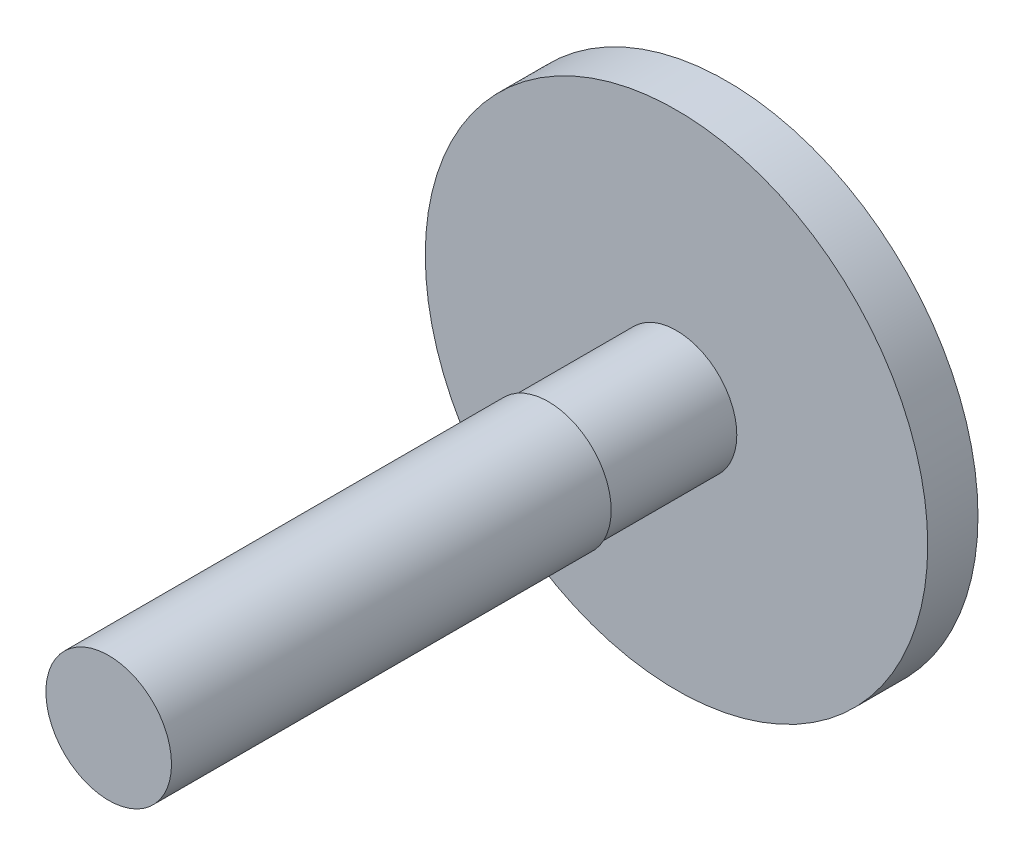
ISO-10303-21;
HEADER;
FILE_DESCRIPTION(('STEP AP214'),'2;1');
FILE_NAME('part.step','',(''),(''),'','','');
FILE_SCHEMA(('AUTOMOTIVE_DESIGN { 1 0 10303 214 1 1 1 1 }'));
ENDSEC;
DATA;
#1=APPLICATION_CONTEXT('core data for automotive mechanical design processes');
#2=APPLICATION_PROTOCOL_DEFINITION('international standard','automotive_design',2000,#1);
#3=PRODUCT_CONTEXT('',#1,'mechanical');
#4=PRODUCT('Part','Part','',(#3));
#5=PRODUCT_RELATED_PRODUCT_CATEGORY('part','',(#4));
#6=PRODUCT_DEFINITION_FORMATION('','',#4);
#7=PRODUCT_DEFINITION_CONTEXT('part definition',#1,'design');
#8=PRODUCT_DEFINITION('design','',#6,#7);
#9=PRODUCT_DEFINITION_SHAPE('','',#8);
#10=(LENGTH_UNIT() NAMED_UNIT(*) SI_UNIT(.MILLI.,.METRE.));
#11=(NAMED_UNIT(*) PLANE_ANGLE_UNIT() SI_UNIT($,.RADIAN.));
#12=(NAMED_UNIT(*) SI_UNIT($,.STERADIAN.) SOLID_ANGLE_UNIT());
#13=UNCERTAINTY_MEASURE_WITH_UNIT(LENGTH_MEASURE(1.E-05),#10,'distance_accuracy_value','');
#14=(GEOMETRIC_REPRESENTATION_CONTEXT(3) GLOBAL_UNCERTAINTY_ASSIGNED_CONTEXT((#13)) GLOBAL_UNIT_ASSIGNED_CONTEXT((#10,
#11,#12)) REPRESENTATION_CONTEXT('',''));
#15=CARTESIAN_POINT('',(0.,0.,0.));
#16=DIRECTION('',(0.,0.,1.));
#17=DIRECTION('',(1.,0.,0.));
#18=AXIS2_PLACEMENT_3D('',#15,#16,#17);
#19=CARTESIAN_POINT('',(0.,0.,2.));
#20=DIRECTION('',(0.,0.,1.));
#21=DIRECTION('',(1.,0.,0.));
#22=AXIS2_PLACEMENT_3D('',#19,#20,#21);
#23=PLANE('',#22);
#24=CARTESIAN_POINT('',(0.,0.,2.));
#25=DIRECTION('',(0.,0.,1.));
#26=DIRECTION('',(1.,0.,0.));
#27=AXIS2_PLACEMENT_3D('',#24,#25,#26);
#28=CIRCLE('',#27,10.);
#29=CARTESIAN_POINT('',(10.,0.,2.));
#30=VERTEX_POINT('',#29);
#31=EDGE_CURVE('E10',#30,#30,#28,.T.);
#32=ORIENTED_EDGE('',*,*,#31,.T.);
#33=EDGE_LOOP('',(#32));
#34=FACE_BOUND('',#33,.T.);
#35=CARTESIAN_POINT('',(0.,0.,2.));
#36=DIRECTION('',(0.,0.,1.));
#37=DIRECTION('',(1.,0.,0.));
#38=AXIS2_PLACEMENT_3D('',#35,#36,#37);
#39=CIRCLE('',#38,2.4);
#40=CARTESIAN_POINT('',(2.4,0.,2.));
#41=VERTEX_POINT('',#40);
#42=EDGE_CURVE('E42',#41,#41,#39,.T.);
#43=ORIENTED_EDGE('',*,*,#42,.F.);
#44=EDGE_LOOP('',(#43));
#45=FACE_BOUND('',#44,.T.);
#46=ADVANCED_FACE('F29',(#34,#45),#23,.T.);
#47=CARTESIAN_POINT('',(0.,0.,2.));
#48=DIRECTION('',(0.,0.,-1.));
#49=DIRECTION('',(-1.,0.,0.));
#50=AXIS2_PLACEMENT_3D('',#47,#48,#49);
#51=CYLINDRICAL_SURFACE('',#50,10.);
#52=ORIENTED_EDGE('',*,*,#31,.F.);
#53=EDGE_LOOP('',(#52));
#54=FACE_BOUND('',#53,.T.);
#55=CARTESIAN_POINT('',(0.,0.,0.));
#56=DIRECTION('',(0.,0.,1.));
#57=DIRECTION('',(1.,0.,0.));
#58=AXIS2_PLACEMENT_3D('',#55,#56,#57);
#59=CIRCLE('',#58,10.);
#60=CARTESIAN_POINT('',(10.,0.,0.));
#61=VERTEX_POINT('',#60);
#62=EDGE_CURVE('E33',#61,#61,#59,.T.);
#63=ORIENTED_EDGE('',*,*,#62,.T.);
#64=EDGE_LOOP('',(#63));
#65=FACE_BOUND('',#64,.T.);
#66=ADVANCED_FACE('F31',(#54,#65),#51,.T.);
#67=CARTESIAN_POINT('',(0.,0.,0.));
#68=DIRECTION('',(0.,0.,1.));
#69=DIRECTION('',(1.,0.,0.));
#70=AXIS2_PLACEMENT_3D('',#67,#68,#69);
#71=PLANE('',#70);
#72=ORIENTED_EDGE('',*,*,#62,.F.);
#73=EDGE_LOOP('',(#72));
#74=FACE_BOUND('',#73,.T.);
#75=ADVANCED_FACE('F71',(#74),#71,.F.);
#76=CARTESIAN_POINT('',(0.,0.,7.1));
#77=DIRECTION('',(0.,0.,-1.));
#78=DIRECTION('',(-1.,0.,0.));
#79=AXIS2_PLACEMENT_3D('',#76,#77,#78);
#80=CYLINDRICAL_SURFACE('',#79,2.4);
#81=CARTESIAN_POINT('',(0.,0.,7.1));
#82=DIRECTION('',(0.,0.,1.));
#83=DIRECTION('',(1.,0.,0.));
#84=AXIS2_PLACEMENT_3D('',#81,#82,#83);
#85=CIRCLE('',#84,2.4);
#86=CARTESIAN_POINT('',(2.4,0.,7.1));
#87=VERTEX_POINT('',#86);
#88=EDGE_CURVE('E40',#87,#87,#85,.T.);
#89=ORIENTED_EDGE('',*,*,#88,.F.);
#90=EDGE_LOOP('',(#89));
#91=FACE_BOUND('',#90,.T.);
#92=ORIENTED_EDGE('',*,*,#42,.T.);
#93=EDGE_LOOP('',(#92));
#94=FACE_BOUND('',#93,.T.);
#95=ADVANCED_FACE('F65',(#91,#94),#80,.T.);
#96=CARTESIAN_POINT('',(0.,0.,7.1));
#97=DIRECTION('',(0.,0.,1.));
#98=DIRECTION('',(1.,0.,0.));
#99=AXIS2_PLACEMENT_3D('',#96,#97,#98);
#100=PLANE('',#99);
#101=CARTESIAN_POINT('',(0.,0.,7.1));
#102=DIRECTION('',(0.,0.,1.));
#103=DIRECTION('',(1.,0.,0.));
#104=AXIS2_PLACEMENT_3D('',#101,#102,#103);
#105=CIRCLE('',#104,2.5);
#106=CARTESIAN_POINT('',(2.5,0.,7.1));
#107=VERTEX_POINT('',#106);
#108=EDGE_CURVE('E48',#107,#107,#105,.T.);
#109=ORIENTED_EDGE('',*,*,#108,.F.);
#110=EDGE_LOOP('',(#109));
#111=FACE_BOUND('',#110,.T.);
#112=ORIENTED_EDGE('',*,*,#88,.T.);
#113=EDGE_LOOP('',(#112));
#114=FACE_BOUND('',#113,.T.);
#115=ADVANCED_FACE('F59',(#111,#114),#100,.F.);
#116=CARTESIAN_POINT('',(0.,0.,24.6));
#117=DIRECTION('',(0.,0.,-1.));
#118=DIRECTION('',(-1.,0.,0.));
#119=AXIS2_PLACEMENT_3D('',#116,#117,#118);
#120=CYLINDRICAL_SURFACE('',#119,2.5);
#121=CARTESIAN_POINT('',(0.,0.,24.6));
#122=DIRECTION('',(0.,0.,1.));
#123=DIRECTION('',(1.,0.,0.));
#124=AXIS2_PLACEMENT_3D('',#121,#122,#123);
#125=CIRCLE('',#124,2.5);
#126=CARTESIAN_POINT('',(2.5,0.,24.6));
#127=VERTEX_POINT('',#126);
#128=EDGE_CURVE('E45',#127,#127,#125,.T.);
#129=ORIENTED_EDGE('',*,*,#128,.F.);
#130=EDGE_LOOP('',(#129));
#131=FACE_BOUND('',#130,.T.);
#132=ORIENTED_EDGE('',*,*,#108,.T.);
#133=EDGE_LOOP('',(#132));
#134=FACE_BOUND('',#133,.T.);
#135=ADVANCED_FACE('F56',(#131,#134),#120,.T.);
#136=CARTESIAN_POINT('',(0.,0.,24.6));
#137=DIRECTION('',(0.,0.,1.));
#138=DIRECTION('',(1.,0.,0.));
#139=AXIS2_PLACEMENT_3D('',#136,#137,#138);
#140=PLANE('',#139);
#141=ORIENTED_EDGE('',*,*,#128,.T.);
#142=EDGE_LOOP('',(#141));
#143=FACE_BOUND('',#142,.T.);
#144=ADVANCED_FACE('F54',(#143),#140,.T.);
#145=CLOSED_SHELL('',(#46,#66,#75,#95,#115,#135,#144));
#146=MANIFOLD_SOLID_BREP('B2',#145);
#147=ADVANCED_BREP_SHAPE_REPRESENTATION('',(#18,#146),#14);
#148=SHAPE_DEFINITION_REPRESENTATION(#9,#147);
ENDSEC;
END-ISO-10303-21;
